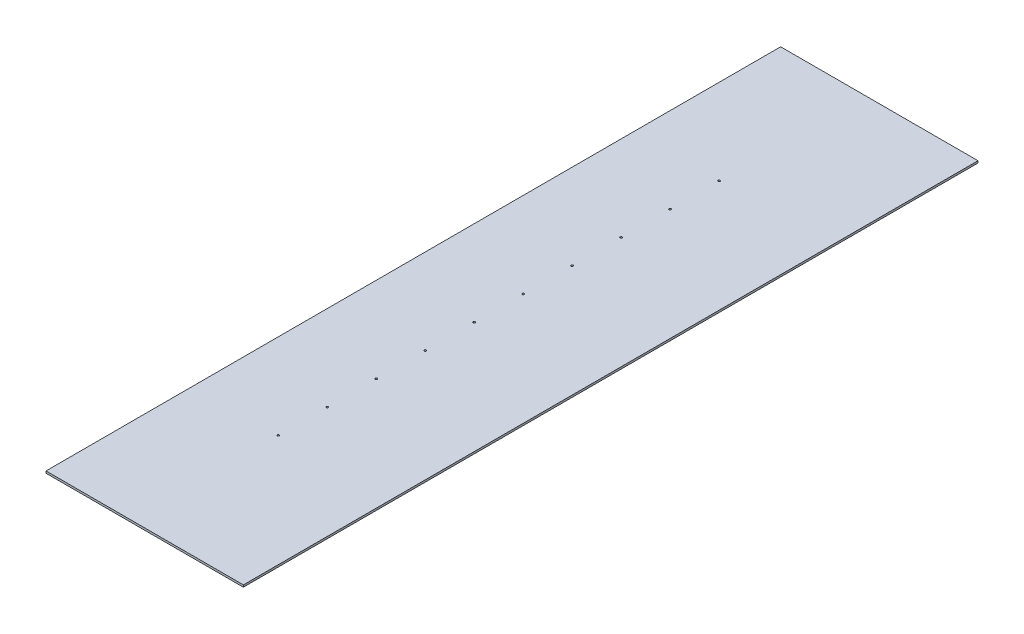
ISO-10303-21;
HEADER;
FILE_DESCRIPTION(('STEP AP214'),'2;1');
FILE_NAME('part.step','',(''),(''),'','','');
FILE_SCHEMA(('AUTOMOTIVE_DESIGN { 1 0 10303 214 1 1 1 1 }'));
ENDSEC;
DATA;
#1=APPLICATION_CONTEXT('core data for automotive mechanical design processes');
#2=APPLICATION_PROTOCOL_DEFINITION('international standard','automotive_design',2000,#1);
#3=PRODUCT_CONTEXT('',#1,'mechanical');
#4=PRODUCT('Part','Part','',(#3));
#5=PRODUCT_RELATED_PRODUCT_CATEGORY('part','',(#4));
#6=PRODUCT_DEFINITION_FORMATION('','',#4);
#7=PRODUCT_DEFINITION_CONTEXT('part definition',#1,'design');
#8=PRODUCT_DEFINITION('design','',#6,#7);
#9=PRODUCT_DEFINITION_SHAPE('','',#8);
#10=(LENGTH_UNIT() NAMED_UNIT(*) SI_UNIT(.MILLI.,.METRE.));
#11=(NAMED_UNIT(*) PLANE_ANGLE_UNIT() SI_UNIT($,.RADIAN.));
#12=(NAMED_UNIT(*) SI_UNIT($,.STERADIAN.) SOLID_ANGLE_UNIT());
#13=UNCERTAINTY_MEASURE_WITH_UNIT(LENGTH_MEASURE(1.E-05),#10,'distance_accuracy_value','');
#14=(GEOMETRIC_REPRESENTATION_CONTEXT(3) GLOBAL_UNCERTAINTY_ASSIGNED_CONTEXT((#13)) GLOBAL_UNIT_ASSIGNED_CONTEXT((#10,
#11,#12)) REPRESENTATION_CONTEXT('',''));
#15=CARTESIAN_POINT('',(0.,0.,0.));
#16=DIRECTION('',(0.,0.,1.));
#17=DIRECTION('',(1.,0.,0.));
#18=AXIS2_PLACEMENT_3D('',#15,#16,#17);
#19=CARTESIAN_POINT('',(-100.,75.,1800.));
#20=DIRECTION('',(0.,0.,1.));
#21=DIRECTION('',(-1.,0.,0.));
#22=AXIS2_PLACEMENT_3D('',#19,#20,#21);
#23=PLANE('',#22);
#24=DIRECTION('',(-1.,0.,0.));
#25=VECTOR('',#24,1.);
#26=CARTESIAN_POINT('',(-100.,75.,1800.));
#27=LINE('',#26,#25);
#28=CARTESIAN_POINT('',(241.780972450962,75.,1800.));
#29=VERTEX_POINT('',#28);
#30=CARTESIAN_POINT('',(-241.780972450962,75.,1800.));
#31=VERTEX_POINT('',#30);
#32=EDGE_CURVE('E12',#29,#31,#27,.T.);
#33=ORIENTED_EDGE('',*,*,#32,.T.);
#34=DIRECTION('',(0.,1.,0.));
#35=VECTOR('',#34,1.);
#36=CARTESIAN_POINT('',(-241.780972450962,75.,1800.));
#37=LINE('',#36,#35);
#38=CARTESIAN_POINT('',(-241.780972450962,70.,1800.));
#39=VERTEX_POINT('',#38);
#40=EDGE_CURVE('E100',#39,#31,#37,.T.);
#41=ORIENTED_EDGE('',*,*,#40,.F.);
#42=DIRECTION('',(1.,0.,0.));
#43=VECTOR('',#42,1.);
#44=CARTESIAN_POINT('',(-100.,70.,1800.));
#45=LINE('',#44,#43);
#46=CARTESIAN_POINT('',(241.780972450962,70.,1800.));
#47=VERTEX_POINT('',#46);
#48=EDGE_CURVE('E71',#47,#39,#45,.F.);
#49=ORIENTED_EDGE('',*,*,#48,.F.);
#50=DIRECTION('',(0.,1.,0.));
#51=VECTOR('',#50,1.);
#52=CARTESIAN_POINT('',(241.780972450962,75.,1800.));
#53=LINE('',#52,#51);
#54=EDGE_CURVE('E98',#47,#29,#53,.T.);
#55=ORIENTED_EDGE('',*,*,#54,.T.);
#56=EDGE_LOOP('',(#33,#41,#49,#55));
#57=FACE_BOUND('',#56,.T.);
#58=ADVANCED_FACE('F51',(#57),#23,.T.);
#59=CARTESIAN_POINT('',(-100.,75.,0.));
#60=DIRECTION('',(0.,0.,1.));
#61=DIRECTION('',(-1.,0.,0.));
#62=AXIS2_PLACEMENT_3D('',#59,#60,#61);
#63=PLANE('',#62);
#64=DIRECTION('',(-1.,0.,0.));
#65=VECTOR('',#64,1.);
#66=CARTESIAN_POINT('',(-100.,75.,0.));
#67=LINE('',#66,#65);
#68=CARTESIAN_POINT('',(241.780972450962,75.,0.));
#69=VERTEX_POINT('',#68);
#70=CARTESIAN_POINT('',(-241.780972450962,75.,0.));
#71=VERTEX_POINT('',#70);
#72=EDGE_CURVE('E62',#69,#71,#67,.T.);
#73=ORIENTED_EDGE('',*,*,#72,.F.);
#74=DIRECTION('',(0.,1.,0.));
#75=VECTOR('',#74,1.);
#76=CARTESIAN_POINT('',(241.780972450962,75.,0.));
#77=LINE('',#76,#75);
#78=CARTESIAN_POINT('',(241.780972450962,70.,0.));
#79=VERTEX_POINT('',#78);
#80=EDGE_CURVE('E115',#79,#69,#77,.T.);
#81=ORIENTED_EDGE('',*,*,#80,.F.);
#82=DIRECTION('',(1.,0.,0.));
#83=VECTOR('',#82,1.);
#84=CARTESIAN_POINT('',(-100.,70.,0.));
#85=LINE('',#84,#83);
#86=CARTESIAN_POINT('',(-241.780972450962,70.,0.));
#87=VERTEX_POINT('',#86);
#88=EDGE_CURVE('E89',#79,#87,#85,.F.);
#89=ORIENTED_EDGE('',*,*,#88,.T.);
#90=DIRECTION('',(0.,1.,0.));
#91=VECTOR('',#90,1.);
#92=CARTESIAN_POINT('',(-241.780972450962,75.,0.));
#93=LINE('',#92,#91);
#94=EDGE_CURVE('E127',#87,#71,#93,.T.);
#95=ORIENTED_EDGE('',*,*,#94,.T.);
#96=EDGE_LOOP('',(#73,#81,#89,#95));
#97=FACE_BOUND('',#96,.T.);
#98=ADVANCED_FACE('F236',(#97),#63,.F.);
#99=CARTESIAN_POINT('',(-32.7,75.,360.));
#100=DIRECTION('',(0.,-1.,0.));
#101=DIRECTION('',(0.,0.,-1.));
#102=AXIS2_PLACEMENT_3D('',#99,#100,#101);
#103=CYLINDRICAL_SURFACE('',#102,2.5);
#104=CARTESIAN_POINT('',(-32.7,75.,360.));
#105=DIRECTION('',(0.,1.,0.));
#106=DIRECTION('',(0.,0.,1.));
#107=AXIS2_PLACEMENT_3D('',#104,#105,#106);
#108=CIRCLE('',#107,2.5);
#109=CARTESIAN_POINT('',(-32.7,75.,362.5));
#110=VERTEX_POINT('',#109);
#111=EDGE_CURVE('E103',#110,#110,#108,.T.);
#112=ORIENTED_EDGE('',*,*,#111,.T.);
#113=EDGE_LOOP('',(#112));
#114=FACE_BOUND('',#113,.T.);
#115=CARTESIAN_POINT('',(-32.7,70.,360.));
#116=DIRECTION('',(0.,1.,0.));
#117=DIRECTION('',(0.,0.,1.));
#118=AXIS2_PLACEMENT_3D('',#115,#116,#117);
#119=CIRCLE('',#118,2.5);
#120=CARTESIAN_POINT('',(-32.7,70.,362.5));
#121=VERTEX_POINT('',#120);
#122=EDGE_CURVE('E126',#121,#121,#119,.T.);
#123=ORIENTED_EDGE('',*,*,#122,.F.);
#124=EDGE_LOOP('',(#123));
#125=FACE_BOUND('',#124,.T.);
#126=ADVANCED_FACE('F241',(#114,#125),#103,.F.);
#127=CARTESIAN_POINT('',(-32.6999999999987,75.,480.));
#128=DIRECTION('',(0.,-1.,0.));
#129=DIRECTION('',(0.,0.,-1.));
#130=AXIS2_PLACEMENT_3D('',#127,#128,#129);
#131=CYLINDRICAL_SURFACE('',#130,2.5);
#132=CARTESIAN_POINT('',(-32.6999999999987,75.,480.));
#133=DIRECTION('',(0.,1.,0.));
#134=DIRECTION('',(0.,0.,1.));
#135=AXIS2_PLACEMENT_3D('',#132,#133,#134);
#136=CIRCLE('',#135,2.5);
#137=CARTESIAN_POINT('',(-32.6999999999987,75.,482.5));
#138=VERTEX_POINT('',#137);
#139=EDGE_CURVE('E139',#138,#138,#136,.T.);
#140=ORIENTED_EDGE('',*,*,#139,.T.);
#141=EDGE_LOOP('',(#140));
#142=FACE_BOUND('',#141,.T.);
#143=CARTESIAN_POINT('',(-32.6999999999987,70.,480.));
#144=DIRECTION('',(0.,1.,0.));
#145=DIRECTION('',(0.,0.,1.));
#146=AXIS2_PLACEMENT_3D('',#143,#144,#145);
#147=CIRCLE('',#146,2.5);
#148=CARTESIAN_POINT('',(-32.6999999999987,70.,482.5));
#149=VERTEX_POINT('',#148);
#150=EDGE_CURVE('E182',#149,#149,#147,.T.);
#151=ORIENTED_EDGE('',*,*,#150,.F.);
#152=EDGE_LOOP('',(#151));
#153=FACE_BOUND('',#152,.T.);
#154=ADVANCED_FACE('F247',(#142,#153),#131,.F.);
#155=CARTESIAN_POINT('',(-32.6999999999975,75.,600.));
#156=DIRECTION('',(0.,-1.,0.));
#157=DIRECTION('',(0.,0.,-1.));
#158=AXIS2_PLACEMENT_3D('',#155,#156,#157);
#159=CYLINDRICAL_SURFACE('',#158,2.5);
#160=CARTESIAN_POINT('',(-32.6999999999975,75.,600.));
#161=DIRECTION('',(0.,1.,0.));
#162=DIRECTION('',(0.,0.,1.));
#163=AXIS2_PLACEMENT_3D('',#160,#161,#162);
#164=CIRCLE('',#163,2.5);
#165=CARTESIAN_POINT('',(-32.6999999999975,75.,602.5));
#166=VERTEX_POINT('',#165);
#167=EDGE_CURVE('E143',#166,#166,#164,.T.);
#168=ORIENTED_EDGE('',*,*,#167,.T.);
#169=EDGE_LOOP('',(#168));
#170=FACE_BOUND('',#169,.T.);
#171=CARTESIAN_POINT('',(-32.6999999999975,70.,600.));
#172=DIRECTION('',(0.,1.,0.));
#173=DIRECTION('',(0.,0.,1.));
#174=AXIS2_PLACEMENT_3D('',#171,#172,#173);
#175=CIRCLE('',#174,2.5);
#176=CARTESIAN_POINT('',(-32.6999999999975,70.,602.5));
#177=VERTEX_POINT('',#176);
#178=EDGE_CURVE('E186',#177,#177,#175,.T.);
#179=ORIENTED_EDGE('',*,*,#178,.F.);
#180=EDGE_LOOP('',(#179));
#181=FACE_BOUND('',#180,.T.);
#182=ADVANCED_FACE('F251',(#170,#181),#159,.F.);
#183=CARTESIAN_POINT('',(-32.6999999999962,75.,720.));
#184=DIRECTION('',(0.,-1.,0.));
#185=DIRECTION('',(0.,0.,-1.));
#186=AXIS2_PLACEMENT_3D('',#183,#184,#185);
#187=CYLINDRICAL_SURFACE('',#186,2.5);
#188=CARTESIAN_POINT('',(-32.6999999999962,75.,720.));
#189=DIRECTION('',(0.,1.,0.));
#190=DIRECTION('',(0.,0.,1.));
#191=AXIS2_PLACEMENT_3D('',#188,#189,#190);
#192=CIRCLE('',#191,2.5);
#193=CARTESIAN_POINT('',(-32.6999999999962,75.,722.5));
#194=VERTEX_POINT('',#193);
#195=EDGE_CURVE('E147',#194,#194,#192,.T.);
#196=ORIENTED_EDGE('',*,*,#195,.T.);
#197=EDGE_LOOP('',(#196));
#198=FACE_BOUND('',#197,.T.);
#199=CARTESIAN_POINT('',(-32.6999999999962,70.,720.));
#200=DIRECTION('',(0.,1.,0.));
#201=DIRECTION('',(0.,0.,1.));
#202=AXIS2_PLACEMENT_3D('',#199,#200,#201);
#203=CIRCLE('',#202,2.5);
#204=CARTESIAN_POINT('',(-32.6999999999962,70.,722.5));
#205=VERTEX_POINT('',#204);
#206=EDGE_CURVE('E190',#205,#205,#203,.T.);
#207=ORIENTED_EDGE('',*,*,#206,.F.);
#208=EDGE_LOOP('',(#207));
#209=FACE_BOUND('',#208,.T.);
#210=ADVANCED_FACE('F255',(#198,#209),#187,.F.);
#211=CARTESIAN_POINT('',(-32.699999999995,75.,840.));
#212=DIRECTION('',(0.,-1.,0.));
#213=DIRECTION('',(0.,0.,-1.));
#214=AXIS2_PLACEMENT_3D('',#211,#212,#213);
#215=CYLINDRICAL_SURFACE('',#214,2.5);
#216=CARTESIAN_POINT('',(-32.699999999995,75.,840.));
#217=DIRECTION('',(0.,1.,0.));
#218=DIRECTION('',(0.,0.,1.));
#219=AXIS2_PLACEMENT_3D('',#216,#217,#218);
#220=CIRCLE('',#219,2.5);
#221=CARTESIAN_POINT('',(-32.699999999995,75.,842.5));
#222=VERTEX_POINT('',#221);
#223=EDGE_CURVE('E151',#222,#222,#220,.T.);
#224=ORIENTED_EDGE('',*,*,#223,.T.);
#225=EDGE_LOOP('',(#224));
#226=FACE_BOUND('',#225,.T.);
#227=CARTESIAN_POINT('',(-32.699999999995,70.,840.));
#228=DIRECTION('',(0.,1.,0.));
#229=DIRECTION('',(0.,0.,1.));
#230=AXIS2_PLACEMENT_3D('',#227,#228,#229);
#231=CIRCLE('',#230,2.5);
#232=CARTESIAN_POINT('',(-32.699999999995,70.,842.5));
#233=VERTEX_POINT('',#232);
#234=EDGE_CURVE('E194',#233,#233,#231,.T.);
#235=ORIENTED_EDGE('',*,*,#234,.F.);
#236=EDGE_LOOP('',(#235));
#237=FACE_BOUND('',#236,.T.);
#238=ADVANCED_FACE('F259',(#226,#237),#215,.F.);
#239=CARTESIAN_POINT('',(-32.6999999999938,75.,960.));
#240=DIRECTION('',(0.,-1.,0.));
#241=DIRECTION('',(0.,0.,-1.));
#242=AXIS2_PLACEMENT_3D('',#239,#240,#241);
#243=CYLINDRICAL_SURFACE('',#242,2.5);
#244=CARTESIAN_POINT('',(-32.6999999999938,75.,960.));
#245=DIRECTION('',(0.,1.,0.));
#246=DIRECTION('',(0.,0.,1.));
#247=AXIS2_PLACEMENT_3D('',#244,#245,#246);
#248=CIRCLE('',#247,2.5);
#249=CARTESIAN_POINT('',(-32.6999999999938,75.,962.5));
#250=VERTEX_POINT('',#249);
#251=EDGE_CURVE('E155',#250,#250,#248,.T.);
#252=ORIENTED_EDGE('',*,*,#251,.T.);
#253=EDGE_LOOP('',(#252));
#254=FACE_BOUND('',#253,.T.);
#255=CARTESIAN_POINT('',(-32.6999999999938,70.,960.));
#256=DIRECTION('',(0.,1.,0.));
#257=DIRECTION('',(0.,0.,1.));
#258=AXIS2_PLACEMENT_3D('',#255,#256,#257);
#259=CIRCLE('',#258,2.5);
#260=CARTESIAN_POINT('',(-32.6999999999938,70.,962.5));
#261=VERTEX_POINT('',#260);
#262=EDGE_CURVE('E198',#261,#261,#259,.T.);
#263=ORIENTED_EDGE('',*,*,#262,.F.);
#264=EDGE_LOOP('',(#263));
#265=FACE_BOUND('',#264,.T.);
#266=ADVANCED_FACE('F263',(#254,#265),#243,.F.);
#267=CARTESIAN_POINT('',(-32.6999999999925,75.,1080.));
#268=DIRECTION('',(0.,-1.,0.));
#269=DIRECTION('',(0.,0.,-1.));
#270=AXIS2_PLACEMENT_3D('',#267,#268,#269);
#271=CYLINDRICAL_SURFACE('',#270,2.50000000000012);
#272=CARTESIAN_POINT('',(-32.6999999999925,75.,1080.));
#273=DIRECTION('',(0.,1.,0.));
#274=DIRECTION('',(0.,0.,1.));
#275=AXIS2_PLACEMENT_3D('',#272,#273,#274);
#276=CIRCLE('',#275,2.50000000000012);
#277=CARTESIAN_POINT('',(-32.6999999999925,75.,1082.5));
#278=VERTEX_POINT('',#277);
#279=EDGE_CURVE('E159',#278,#278,#276,.T.);
#280=ORIENTED_EDGE('',*,*,#279,.T.);
#281=EDGE_LOOP('',(#280));
#282=FACE_BOUND('',#281,.T.);
#283=CARTESIAN_POINT('',(-32.6999999999925,70.,1080.));
#284=DIRECTION('',(0.,1.,0.));
#285=DIRECTION('',(0.,0.,1.));
#286=AXIS2_PLACEMENT_3D('',#283,#284,#285);
#287=CIRCLE('',#286,2.50000000000012);
#288=CARTESIAN_POINT('',(-32.6999999999925,70.,1082.5));
#289=VERTEX_POINT('',#288);
#290=EDGE_CURVE('E202',#289,#289,#287,.T.);
#291=ORIENTED_EDGE('',*,*,#290,.F.);
#292=EDGE_LOOP('',(#291));
#293=FACE_BOUND('',#292,.T.);
#294=ADVANCED_FACE('F267',(#282,#293),#271,.F.);
#295=CARTESIAN_POINT('',(-32.6999999999912,75.,1200.));
#296=DIRECTION('',(0.,-1.,0.));
#297=DIRECTION('',(0.,0.,-1.));
#298=AXIS2_PLACEMENT_3D('',#295,#296,#297);
#299=CYLINDRICAL_SURFACE('',#298,2.50000000000012);
#300=CARTESIAN_POINT('',(-32.6999999999912,75.,1200.));
#301=DIRECTION('',(0.,1.,0.));
#302=DIRECTION('',(0.,0.,1.));
#303=AXIS2_PLACEMENT_3D('',#300,#301,#302);
#304=CIRCLE('',#303,2.50000000000012);
#305=CARTESIAN_POINT('',(-32.6999999999912,75.,1202.5));
#306=VERTEX_POINT('',#305);
#307=EDGE_CURVE('E163',#306,#306,#304,.T.);
#308=ORIENTED_EDGE('',*,*,#307,.T.);
#309=EDGE_LOOP('',(#308));
#310=FACE_BOUND('',#309,.T.);
#311=CARTESIAN_POINT('',(-32.6999999999912,70.,1200.));
#312=DIRECTION('',(0.,1.,0.));
#313=DIRECTION('',(0.,0.,1.));
#314=AXIS2_PLACEMENT_3D('',#311,#312,#313);
#315=CIRCLE('',#314,2.50000000000012);
#316=CARTESIAN_POINT('',(-32.6999999999912,70.,1202.5));
#317=VERTEX_POINT('',#316);
#318=EDGE_CURVE('E206',#317,#317,#315,.T.);
#319=ORIENTED_EDGE('',*,*,#318,.F.);
#320=EDGE_LOOP('',(#319));
#321=FACE_BOUND('',#320,.T.);
#322=ADVANCED_FACE('F232',(#310,#321),#299,.F.);
#323=CARTESIAN_POINT('',(-32.69999999999,75.,1320.));
#324=DIRECTION('',(0.,-1.,0.));
#325=DIRECTION('',(0.,0.,-1.));
#326=AXIS2_PLACEMENT_3D('',#323,#324,#325);
#327=CYLINDRICAL_SURFACE('',#326,2.49999999999989);
#328=CARTESIAN_POINT('',(-32.69999999999,75.,1320.));
#329=DIRECTION('',(0.,1.,0.));
#330=DIRECTION('',(0.,0.,1.));
#331=AXIS2_PLACEMENT_3D('',#328,#329,#330);
#332=CIRCLE('',#331,2.49999999999989);
#333=CARTESIAN_POINT('',(-32.69999999999,75.,1322.5));
#334=VERTEX_POINT('',#333);
#335=EDGE_CURVE('E167',#334,#334,#332,.T.);
#336=ORIENTED_EDGE('',*,*,#335,.T.);
#337=EDGE_LOOP('',(#336));
#338=FACE_BOUND('',#337,.T.);
#339=CARTESIAN_POINT('',(-32.69999999999,70.,1320.));
#340=DIRECTION('',(0.,1.,0.));
#341=DIRECTION('',(0.,0.,1.));
#342=AXIS2_PLACEMENT_3D('',#339,#340,#341);
#343=CIRCLE('',#342,2.49999999999989);
#344=CARTESIAN_POINT('',(-32.69999999999,70.,1322.5));
#345=VERTEX_POINT('',#344);
#346=EDGE_CURVE('E209',#345,#345,#343,.T.);
#347=ORIENTED_EDGE('',*,*,#346,.F.);
#348=EDGE_LOOP('',(#347));
#349=FACE_BOUND('',#348,.T.);
#350=ADVANCED_FACE('F225',(#338,#349),#327,.F.);
#351=CARTESIAN_POINT('',(-32.6999999999887,75.,1440.));
#352=DIRECTION('',(0.,-1.,0.));
#353=DIRECTION('',(0.,0.,-1.));
#354=AXIS2_PLACEMENT_3D('',#351,#352,#353);
#355=CYLINDRICAL_SURFACE('',#354,2.49999999999989);
#356=CARTESIAN_POINT('',(-32.6999999999887,75.,1440.));
#357=DIRECTION('',(0.,1.,0.));
#358=DIRECTION('',(0.,0.,1.));
#359=AXIS2_PLACEMENT_3D('',#356,#357,#358);
#360=CIRCLE('',#359,2.49999999999989);
#361=CARTESIAN_POINT('',(-32.6999999999887,75.,1442.5));
#362=VERTEX_POINT('',#361);
#363=EDGE_CURVE('E171',#362,#362,#360,.T.);
#364=ORIENTED_EDGE('',*,*,#363,.T.);
#365=EDGE_LOOP('',(#364));
#366=FACE_BOUND('',#365,.T.);
#367=CARTESIAN_POINT('',(-32.6999999999887,70.,1440.));
#368=DIRECTION('',(0.,1.,0.));
#369=DIRECTION('',(0.,0.,1.));
#370=AXIS2_PLACEMENT_3D('',#367,#368,#369);
#371=CIRCLE('',#370,2.49999999999989);
#372=CARTESIAN_POINT('',(-32.6999999999887,70.,1442.5));
#373=VERTEX_POINT('',#372);
#374=EDGE_CURVE('E55',#373,#373,#371,.T.);
#375=ORIENTED_EDGE('',*,*,#374,.F.);
#376=EDGE_LOOP('',(#375));
#377=FACE_BOUND('',#376,.T.);
#378=ADVANCED_FACE('F223',(#366,#377),#355,.F.);
#379=CARTESIAN_POINT('',(-100.,75.,1800.));
#380=DIRECTION('',(0.,-1.,0.));
#381=DIRECTION('',(0.,0.,-1.));
#382=AXIS2_PLACEMENT_3D('',#379,#380,#381);
#383=PLANE('',#382);
#384=ORIENTED_EDGE('',*,*,#111,.F.);
#385=EDGE_LOOP('',(#384));
#386=FACE_BOUND('',#385,.T.);
#387=ORIENTED_EDGE('',*,*,#139,.F.);
#388=EDGE_LOOP('',(#387));
#389=FACE_BOUND('',#388,.T.);
#390=ORIENTED_EDGE('',*,*,#167,.F.);
#391=EDGE_LOOP('',(#390));
#392=FACE_BOUND('',#391,.T.);
#393=ORIENTED_EDGE('',*,*,#195,.F.);
#394=EDGE_LOOP('',(#393));
#395=FACE_BOUND('',#394,.T.);
#396=ORIENTED_EDGE('',*,*,#223,.F.);
#397=EDGE_LOOP('',(#396));
#398=FACE_BOUND('',#397,.T.);
#399=ORIENTED_EDGE('',*,*,#251,.F.);
#400=EDGE_LOOP('',(#399));
#401=FACE_BOUND('',#400,.T.);
#402=ORIENTED_EDGE('',*,*,#279,.F.);
#403=EDGE_LOOP('',(#402));
#404=FACE_BOUND('',#403,.T.);
#405=ORIENTED_EDGE('',*,*,#307,.F.);
#406=EDGE_LOOP('',(#405));
#407=FACE_BOUND('',#406,.T.);
#408=ORIENTED_EDGE('',*,*,#335,.F.);
#409=EDGE_LOOP('',(#408));
#410=FACE_BOUND('',#409,.T.);
#411=ORIENTED_EDGE('',*,*,#363,.F.);
#412=EDGE_LOOP('',(#411));
#413=FACE_BOUND('',#412,.T.);
#414=ORIENTED_EDGE('',*,*,#72,.T.);
#415=DIRECTION('',(0.,0.,-1.));
#416=VECTOR('',#415,1.);
#417=CARTESIAN_POINT('',(-241.780972450962,75.,1800.));
#418=LINE('',#417,#416);
#419=EDGE_CURVE('E130',#31,#71,#418,.T.);
#420=ORIENTED_EDGE('',*,*,#419,.F.);
#421=ORIENTED_EDGE('',*,*,#32,.F.);
#422=DIRECTION('',(0.,0.,-1.));
#423=VECTOR('',#422,1.);
#424=CARTESIAN_POINT('',(241.780972450962,75.,1800.));
#425=LINE('',#424,#423);
#426=EDGE_CURVE('E110',#29,#69,#425,.T.);
#427=ORIENTED_EDGE('',*,*,#426,.T.);
#428=EDGE_LOOP('',(#414,#420,#421,#427));
#429=FACE_BOUND('',#428,.T.);
#430=ADVANCED_FACE('F53',(#386,#389,#392,#395,#398,#401,#404,#407,#410,#413,#429),#383,.F.);
#431=CARTESIAN_POINT('',(-100.,70.,1800.));
#432=DIRECTION('',(0.,-1.,0.));
#433=DIRECTION('',(0.,0.,-1.));
#434=AXIS2_PLACEMENT_3D('',#431,#432,#433);
#435=PLANE('',#434);
#436=ORIENTED_EDGE('',*,*,#122,.T.);
#437=EDGE_LOOP('',(#436));
#438=FACE_BOUND('',#437,.T.);
#439=ORIENTED_EDGE('',*,*,#150,.T.);
#440=EDGE_LOOP('',(#439));
#441=FACE_BOUND('',#440,.T.);
#442=ORIENTED_EDGE('',*,*,#178,.T.);
#443=EDGE_LOOP('',(#442));
#444=FACE_BOUND('',#443,.T.);
#445=ORIENTED_EDGE('',*,*,#206,.T.);
#446=EDGE_LOOP('',(#445));
#447=FACE_BOUND('',#446,.T.);
#448=ORIENTED_EDGE('',*,*,#234,.T.);
#449=EDGE_LOOP('',(#448));
#450=FACE_BOUND('',#449,.T.);
#451=ORIENTED_EDGE('',*,*,#262,.T.);
#452=EDGE_LOOP('',(#451));
#453=FACE_BOUND('',#452,.T.);
#454=ORIENTED_EDGE('',*,*,#290,.T.);
#455=EDGE_LOOP('',(#454));
#456=FACE_BOUND('',#455,.T.);
#457=ORIENTED_EDGE('',*,*,#318,.T.);
#458=EDGE_LOOP('',(#457));
#459=FACE_BOUND('',#458,.T.);
#460=ORIENTED_EDGE('',*,*,#346,.T.);
#461=EDGE_LOOP('',(#460));
#462=FACE_BOUND('',#461,.T.);
#463=ORIENTED_EDGE('',*,*,#374,.T.);
#464=EDGE_LOOP('',(#463));
#465=FACE_BOUND('',#464,.T.);
#466=ORIENTED_EDGE('',*,*,#88,.F.);
#467=DIRECTION('',(0.,0.,1.));
#468=VECTOR('',#467,1.);
#469=CARTESIAN_POINT('',(241.780972450962,70.,1800.));
#470=LINE('',#469,#468);
#471=EDGE_CURVE('E108',#47,#79,#470,.F.);
#472=ORIENTED_EDGE('',*,*,#471,.F.);
#473=ORIENTED_EDGE('',*,*,#48,.T.);
#474=DIRECTION('',(0.,0.,1.));
#475=VECTOR('',#474,1.);
#476=CARTESIAN_POINT('',(-241.780972450962,70.,1800.));
#477=LINE('',#476,#475);
#478=EDGE_CURVE('E123',#39,#87,#477,.F.);
#479=ORIENTED_EDGE('',*,*,#478,.T.);
#480=EDGE_LOOP('',(#466,#472,#473,#479));
#481=FACE_BOUND('',#480,.T.);
#482=ADVANCED_FACE('F113',(#438,#441,#444,#447,#450,#453,#456,#459,#462,#465,#481),#435,.T.);
#483=CARTESIAN_POINT('',(-241.780972450962,75.,1800.));
#484=DIRECTION('',(-1.,0.,0.));
#485=DIRECTION('',(0.,0.,-1.));
#486=AXIS2_PLACEMENT_3D('',#483,#484,#485);
#487=PLANE('',#486);
#488=ORIENTED_EDGE('',*,*,#94,.F.);
#489=ORIENTED_EDGE('',*,*,#478,.F.);
#490=ORIENTED_EDGE('',*,*,#40,.T.);
#491=ORIENTED_EDGE('',*,*,#419,.T.);
#492=EDGE_LOOP('',(#488,#489,#490,#491));
#493=FACE_BOUND('',#492,.T.);
#494=ADVANCED_FACE('F281',(#493),#487,.T.);
#495=CARTESIAN_POINT('',(241.780972450962,75.,1800.));
#496=DIRECTION('',(-1.,0.,0.));
#497=DIRECTION('',(0.,0.,-1.));
#498=AXIS2_PLACEMENT_3D('',#495,#496,#497);
#499=PLANE('',#498);
#500=ORIENTED_EDGE('',*,*,#54,.F.);
#501=ORIENTED_EDGE('',*,*,#471,.T.);
#502=ORIENTED_EDGE('',*,*,#80,.T.);
#503=ORIENTED_EDGE('',*,*,#426,.F.);
#504=EDGE_LOOP('',(#500,#501,#502,#503));
#505=FACE_BOUND('',#504,.T.);
#506=ADVANCED_FACE('F107',(#505),#499,.F.);
#507=CLOSED_SHELL('',(#58,#98,#126,#154,#182,#210,#238,#266,#294,#322,#350,#378,#430,#482,#494,#506));
#508=MANIFOLD_SOLID_BREP('B2',#507);
#509=ADVANCED_BREP_SHAPE_REPRESENTATION('',(#18,#508),#14);
#510=SHAPE_DEFINITION_REPRESENTATION(#9,#509);
ENDSEC;
END-ISO-10303-21;
